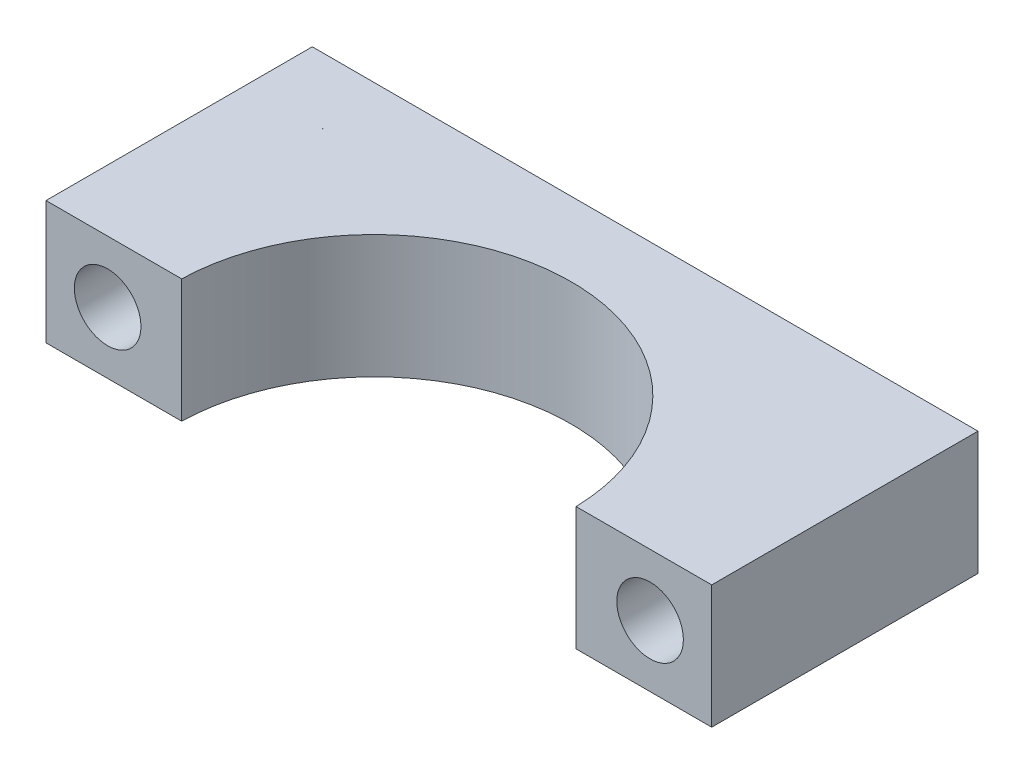
ISO-10303-21;
HEADER;
FILE_DESCRIPTION(('STEP AP214'),'2;1');
FILE_NAME('part.step','',(''),(''),'','','');
FILE_SCHEMA(('AUTOMOTIVE_DESIGN { 1 0 10303 214 1 1 1 1 }'));
ENDSEC;
DATA;
#1=APPLICATION_CONTEXT('core data for automotive mechanical design processes');
#2=APPLICATION_PROTOCOL_DEFINITION('international standard','automotive_design',2000,#1);
#3=PRODUCT_CONTEXT('',#1,'mechanical');
#4=PRODUCT('Part','Part','',(#3));
#5=PRODUCT_RELATED_PRODUCT_CATEGORY('part','',(#4));
#6=PRODUCT_DEFINITION_FORMATION('','',#4);
#7=PRODUCT_DEFINITION_CONTEXT('part definition',#1,'design');
#8=PRODUCT_DEFINITION('design','',#6,#7);
#9=PRODUCT_DEFINITION_SHAPE('','',#8);
#10=(LENGTH_UNIT() NAMED_UNIT(*) SI_UNIT(.MILLI.,.METRE.));
#11=(NAMED_UNIT(*) PLANE_ANGLE_UNIT() SI_UNIT($,.RADIAN.));
#12=(NAMED_UNIT(*) SI_UNIT($,.STERADIAN.) SOLID_ANGLE_UNIT());
#13=UNCERTAINTY_MEASURE_WITH_UNIT(LENGTH_MEASURE(1.E-05),#10,'distance_accuracy_value','');
#14=(GEOMETRIC_REPRESENTATION_CONTEXT(3) GLOBAL_UNCERTAINTY_ASSIGNED_CONTEXT((#13)) GLOBAL_UNIT_ASSIGNED_CONTEXT((#10,
#11,#12)) REPRESENTATION_CONTEXT('',''));
#15=CARTESIAN_POINT('',(0.,0.,0.));
#16=DIRECTION('',(0.,0.,1.));
#17=DIRECTION('',(1.,0.,0.));
#18=AXIS2_PLACEMENT_3D('',#15,#16,#17);
#19=CARTESIAN_POINT('',(-11.,2.5,-5.05999999999998));
#20=DIRECTION('',(0.,0.,1.));
#21=DIRECTION('',(1.,0.,0.));
#22=AXIS2_PLACEMENT_3D('',#19,#20,#21);
#23=CYLINDRICAL_SURFACE('',#22,1.35);
#24=CARTESIAN_POINT('',(-11.,2.5,-0.199999999999971));
#25=DIRECTION('',(0.,0.,-1.));
#26=DIRECTION('',(-1.,0.,0.));
#27=AXIS2_PLACEMENT_3D('',#24,#25,#26);
#28=CIRCLE('',#27,1.35);
#29=CARTESIAN_POINT('',(-12.35,2.5,-0.199999999999966));
#30=VERTEX_POINT('',#29);
#31=EDGE_CURVE('E101',#30,#30,#28,.T.);
#32=ORIENTED_EDGE('',*,*,#31,.F.);
#33=EDGE_LOOP('',(#32));
#34=FACE_BOUND('',#33,.T.);
#35=CARTESIAN_POINT('',(-11.,2.5,-11.));
#36=DIRECTION('',(0.,0.,1.));
#37=DIRECTION('',(1.,0.,0.));
#38=AXIS2_PLACEMENT_3D('',#35,#36,#37);
#39=CIRCLE('',#38,1.35);
#40=CARTESIAN_POINT('',(-9.65000000000001,2.5,-11.));
#41=VERTEX_POINT('',#40);
#42=EDGE_CURVE('E120',#41,#41,#39,.T.);
#43=ORIENTED_EDGE('',*,*,#42,.F.);
#44=EDGE_LOOP('',(#43));
#45=FACE_BOUND('',#44,.T.);
#46=ADVANCED_FACE('F17',(#34,#45),#23,.F.);
#47=CARTESIAN_POINT('',(11.,2.5,-5.05999999999999));
#48=DIRECTION('',(0.,0.,1.));
#49=DIRECTION('',(1.,0.,0.));
#50=AXIS2_PLACEMENT_3D('',#47,#48,#49);
#51=CYLINDRICAL_SURFACE('',#50,1.35);
#52=CARTESIAN_POINT('',(11.,2.5,-0.199999999999997));
#53=DIRECTION('',(0.,0.,-1.));
#54=DIRECTION('',(-1.,0.,0.));
#55=AXIS2_PLACEMENT_3D('',#52,#53,#54);
#56=CIRCLE('',#55,1.35);
#57=CARTESIAN_POINT('',(9.65,2.5,-0.199999999999997));
#58=VERTEX_POINT('',#57);
#59=EDGE_CURVE('E11',#58,#58,#56,.T.);
#60=ORIENTED_EDGE('',*,*,#59,.F.);
#61=EDGE_LOOP('',(#60));
#62=FACE_BOUND('',#61,.T.);
#63=CARTESIAN_POINT('',(11.,2.5,-11.));
#64=DIRECTION('',(0.,0.,1.));
#65=DIRECTION('',(1.,0.,0.));
#66=AXIS2_PLACEMENT_3D('',#63,#64,#65);
#67=CIRCLE('',#66,1.35);
#68=CARTESIAN_POINT('',(12.35,2.5,-11.));
#69=VERTEX_POINT('',#68);
#70=EDGE_CURVE('E124',#69,#69,#67,.T.);
#71=ORIENTED_EDGE('',*,*,#70,.F.);
#72=EDGE_LOOP('',(#71));
#73=FACE_BOUND('',#72,.T.);
#74=ADVANCED_FACE('F148',(#62,#73),#51,.F.);
#75=CARTESIAN_POINT('',(7.99749960925288,0.,-0.199999999999996));
#76=DIRECTION('',(0.,0.,1.));
#77=DIRECTION('',(1.,0.,0.));
#78=AXIS2_PLACEMENT_3D('',#75,#76,#77);
#79=PLANE('',#78);
#80=ORIENTED_EDGE('',*,*,#59,.T.);
#81=EDGE_LOOP('',(#80));
#82=FACE_BOUND('',#81,.T.);
#83=DIRECTION('',(-1.,0.,0.));
#84=VECTOR('',#83,1.);
#85=CARTESIAN_POINT('',(13.5,0.,-0.199999999999998));
#86=LINE('',#85,#84);
#87=CARTESIAN_POINT('',(13.5,0.,-0.199999999999998));
#88=VERTEX_POINT('',#87);
#89=CARTESIAN_POINT('',(7.99749960925288,0.,-0.199999999999996));
#90=VERTEX_POINT('',#89);
#91=EDGE_CURVE('E36',#88,#90,#86,.T.);
#92=ORIENTED_EDGE('',*,*,#91,.F.);
#93=DIRECTION('',(0.,1.,0.));
#94=VECTOR('',#93,1.);
#95=CARTESIAN_POINT('',(13.5,0.,-0.199999999999998));
#96=LINE('',#95,#94);
#97=CARTESIAN_POINT('',(13.5,5.,-0.199999999999998));
#98=VERTEX_POINT('',#97);
#99=EDGE_CURVE('E27',#88,#98,#96,.T.);
#100=ORIENTED_EDGE('',*,*,#99,.T.);
#101=DIRECTION('',(1.,0.,0.));
#102=VECTOR('',#101,1.);
#103=CARTESIAN_POINT('',(13.5,5.,-0.199999999999998));
#104=LINE('',#103,#102);
#105=CARTESIAN_POINT('',(7.99749960925288,5.,-0.199999999999996));
#106=VERTEX_POINT('',#105);
#107=EDGE_CURVE('E93',#106,#98,#104,.T.);
#108=ORIENTED_EDGE('',*,*,#107,.F.);
#109=DIRECTION('',(0.,1.,0.));
#110=VECTOR('',#109,1.);
#111=CARTESIAN_POINT('',(7.99749960925288,0.,-0.199999999999996));
#112=LINE('',#111,#110);
#113=EDGE_CURVE('E99',#90,#106,#112,.T.);
#114=ORIENTED_EDGE('',*,*,#113,.F.);
#115=EDGE_LOOP('',(#92,#100,#108,#114));
#116=FACE_BOUND('',#115,.T.);
#117=ADVANCED_FACE('F98',(#82,#116),#79,.T.);
#118=CARTESIAN_POINT('',(0.,0.,0.));
#119=DIRECTION('',(0.,1.,0.));
#120=DIRECTION('',(1.,0.,0.));
#121=AXIS2_PLACEMENT_3D('',#118,#119,#120);
#122=CYLINDRICAL_SURFACE('',#121,8.);
#123=CARTESIAN_POINT('',(0.,0.,0.));
#124=DIRECTION('',(0.,1.,0.));
#125=DIRECTION('',(1.,0.,0.));
#126=AXIS2_PLACEMENT_3D('',#123,#124,#125);
#127=CIRCLE('',#126,8.);
#128=CARTESIAN_POINT('',(-7.99749960925363,0.,-0.199999999999989));
#129=VERTEX_POINT('',#128);
#130=EDGE_CURVE('E106',#90,#129,#127,.T.);
#131=ORIENTED_EDGE('',*,*,#130,.F.);
#132=ORIENTED_EDGE('',*,*,#113,.T.);
#133=CARTESIAN_POINT('',(0.,5.,0.));
#134=DIRECTION('',(0.,-1.,0.));
#135=DIRECTION('',(0.,0.,-1.));
#136=AXIS2_PLACEMENT_3D('',#133,#134,#135);
#137=CIRCLE('',#136,8.);
#138=CARTESIAN_POINT('',(-7.99749960925363,5.,-0.199999999999989));
#139=VERTEX_POINT('',#138);
#140=EDGE_CURVE('E95',#139,#106,#137,.T.);
#141=ORIENTED_EDGE('',*,*,#140,.F.);
#142=DIRECTION('',(0.,1.,0.));
#143=VECTOR('',#142,1.);
#144=CARTESIAN_POINT('',(-7.99749960925363,0.,-0.199999999999989));
#145=LINE('',#144,#143);
#146=EDGE_CURVE('E111',#129,#139,#145,.T.);
#147=ORIENTED_EDGE('',*,*,#146,.F.);
#148=EDGE_LOOP('',(#131,#132,#141,#147));
#149=FACE_BOUND('',#148,.T.);
#150=ADVANCED_FACE('F19',(#149),#122,.F.);
#151=CARTESIAN_POINT('',(-13.5,0.,-0.19999999999997));
#152=DIRECTION('',(0.,0.,1.));
#153=DIRECTION('',(1.,0.,0.));
#154=AXIS2_PLACEMENT_3D('',#151,#152,#153);
#155=PLANE('',#154);
#156=ORIENTED_EDGE('',*,*,#31,.T.);
#157=EDGE_LOOP('',(#156));
#158=FACE_BOUND('',#157,.T.);
#159=DIRECTION('',(-1.,0.,0.));
#160=VECTOR('',#159,1.);
#161=CARTESIAN_POINT('',(-7.99749960925363,0.,-0.199999999999989));
#162=LINE('',#161,#160);
#163=CARTESIAN_POINT('',(-13.5,0.,-0.19999999999997));
#164=VERTEX_POINT('',#163);
#165=EDGE_CURVE('E108',#129,#164,#162,.T.);
#166=ORIENTED_EDGE('',*,*,#165,.F.);
#167=ORIENTED_EDGE('',*,*,#146,.T.);
#168=DIRECTION('',(1.,0.,0.));
#169=VECTOR('',#168,1.);
#170=CARTESIAN_POINT('',(-7.99749960925363,5.,-0.199999999999989));
#171=LINE('',#170,#169);
#172=CARTESIAN_POINT('',(-13.5,5.,-0.199999999999969));
#173=VERTEX_POINT('',#172);
#174=EDGE_CURVE('E110',#173,#139,#171,.T.);
#175=ORIENTED_EDGE('',*,*,#174,.F.);
#176=DIRECTION('',(0.,1.,0.));
#177=VECTOR('',#176,1.);
#178=CARTESIAN_POINT('',(-13.5,0.,-0.19999999999997));
#179=LINE('',#178,#177);
#180=EDGE_CURVE('E114',#164,#173,#179,.T.);
#181=ORIENTED_EDGE('',*,*,#180,.F.);
#182=EDGE_LOOP('',(#166,#167,#175,#181));
#183=FACE_BOUND('',#182,.T.);
#184=ADVANCED_FACE('F132',(#158,#183),#155,.T.);
#185=CARTESIAN_POINT('',(-13.5,0.,-11.));
#186=DIRECTION('',(-1.,0.,0.));
#187=DIRECTION('',(0.,0.,1.));
#188=AXIS2_PLACEMENT_3D('',#185,#186,#187);
#189=PLANE('',#188);
#190=DIRECTION('',(0.,0.,-1.));
#191=VECTOR('',#190,1.);
#192=CARTESIAN_POINT('',(-13.5,0.,-0.19999999999997));
#193=LINE('',#192,#191);
#194=CARTESIAN_POINT('',(-13.5,0.,-11.));
#195=VERTEX_POINT('',#194);
#196=EDGE_CURVE('E116',#164,#195,#193,.T.);
#197=ORIENTED_EDGE('',*,*,#196,.F.);
#198=ORIENTED_EDGE('',*,*,#180,.T.);
#199=DIRECTION('',(0.,0.,1.));
#200=VECTOR('',#199,1.);
#201=CARTESIAN_POINT('',(-13.5,5.,-0.19999999999997));
#202=LINE('',#201,#200);
#203=CARTESIAN_POINT('',(-13.5,5.,-11.));
#204=VERTEX_POINT('',#203);
#205=EDGE_CURVE('E84',#204,#173,#202,.T.);
#206=ORIENTED_EDGE('',*,*,#205,.F.);
#207=DIRECTION('',(0.,1.,0.));
#208=VECTOR('',#207,1.);
#209=CARTESIAN_POINT('',(-13.5,0.,-11.));
#210=LINE('',#209,#208);
#211=EDGE_CURVE('E80',#195,#204,#210,.T.);
#212=ORIENTED_EDGE('',*,*,#211,.F.);
#213=EDGE_LOOP('',(#197,#198,#206,#212));
#214=FACE_BOUND('',#213,.T.);
#215=ADVANCED_FACE('F135',(#214),#189,.T.);
#216=CARTESIAN_POINT('',(13.5,0.,-11.));
#217=DIRECTION('',(0.,0.,-1.));
#218=DIRECTION('',(-1.,0.,0.));
#219=AXIS2_PLACEMENT_3D('',#216,#217,#218);
#220=PLANE('',#219);
#221=ORIENTED_EDGE('',*,*,#42,.T.);
#222=EDGE_LOOP('',(#221));
#223=FACE_BOUND('',#222,.T.);
#224=ORIENTED_EDGE('',*,*,#70,.T.);
#225=EDGE_LOOP('',(#224));
#226=FACE_BOUND('',#225,.T.);
#227=DIRECTION('',(1.,0.,0.));
#228=VECTOR('',#227,1.);
#229=CARTESIAN_POINT('',(-13.5,0.,-11.));
#230=LINE('',#229,#228);
#231=CARTESIAN_POINT('',(13.5,0.,-11.));
#232=VERTEX_POINT('',#231);
#233=EDGE_CURVE('E68',#195,#232,#230,.T.);
#234=ORIENTED_EDGE('',*,*,#233,.F.);
#235=ORIENTED_EDGE('',*,*,#211,.T.);
#236=DIRECTION('',(-1.,0.,0.));
#237=VECTOR('',#236,1.);
#238=CARTESIAN_POINT('',(-13.5,5.,-11.));
#239=LINE('',#238,#237);
#240=CARTESIAN_POINT('',(13.5,5.,-11.));
#241=VERTEX_POINT('',#240);
#242=EDGE_CURVE('E74',#241,#204,#239,.T.);
#243=ORIENTED_EDGE('',*,*,#242,.F.);
#244=DIRECTION('',(0.,1.,0.));
#245=VECTOR('',#244,1.);
#246=CARTESIAN_POINT('',(13.5,0.,-11.));
#247=LINE('',#246,#245);
#248=EDGE_CURVE('E77',#232,#241,#247,.T.);
#249=ORIENTED_EDGE('',*,*,#248,.F.);
#250=EDGE_LOOP('',(#234,#235,#243,#249));
#251=FACE_BOUND('',#250,.T.);
#252=ADVANCED_FACE('F76',(#223,#226,#251),#220,.T.);
#253=CARTESIAN_POINT('',(13.5,0.,-0.199999999999998));
#254=DIRECTION('',(1.,0.,0.));
#255=DIRECTION('',(0.,0.,-1.));
#256=AXIS2_PLACEMENT_3D('',#253,#254,#255);
#257=PLANE('',#256);
#258=DIRECTION('',(0.,0.,1.));
#259=VECTOR('',#258,1.);
#260=CARTESIAN_POINT('',(13.5,0.,-11.));
#261=LINE('',#260,#259);
#262=EDGE_CURVE('E89',#232,#88,#261,.T.);
#263=ORIENTED_EDGE('',*,*,#262,.F.);
#264=ORIENTED_EDGE('',*,*,#248,.T.);
#265=DIRECTION('',(0.,0.,-1.));
#266=VECTOR('',#265,1.);
#267=CARTESIAN_POINT('',(13.5,5.,-11.));
#268=LINE('',#267,#266);
#269=EDGE_CURVE('E21',#98,#241,#268,.T.);
#270=ORIENTED_EDGE('',*,*,#269,.F.);
#271=ORIENTED_EDGE('',*,*,#99,.F.);
#272=EDGE_LOOP('',(#263,#264,#270,#271));
#273=FACE_BOUND('',#272,.T.);
#274=ADVANCED_FACE('F88',(#273),#257,.T.);
#275=CARTESIAN_POINT('',(0.,5.,-5.59999999999999));
#276=DIRECTION('',(0.,1.,0.));
#277=DIRECTION('',(0.,0.,1.));
#278=AXIS2_PLACEMENT_3D('',#275,#276,#277);
#279=PLANE('',#278);
#280=ORIENTED_EDGE('',*,*,#269,.T.);
#281=ORIENTED_EDGE('',*,*,#242,.T.);
#282=ORIENTED_EDGE('',*,*,#205,.T.);
#283=ORIENTED_EDGE('',*,*,#174,.T.);
#284=ORIENTED_EDGE('',*,*,#140,.T.);
#285=ORIENTED_EDGE('',*,*,#107,.T.);
#286=EDGE_LOOP('',(#280,#281,#282,#283,#284,#285));
#287=FACE_BOUND('',#286,.T.);
#288=ADVANCED_FACE('F91',(#287),#279,.T.);
#289=CARTESIAN_POINT('',(0.,0.,-5.59999999999999));
#290=DIRECTION('',(0.,1.,0.));
#291=DIRECTION('',(0.,0.,1.));
#292=AXIS2_PLACEMENT_3D('',#289,#290,#291);
#293=PLANE('',#292);
#294=ORIENTED_EDGE('',*,*,#262,.T.);
#295=ORIENTED_EDGE('',*,*,#91,.T.);
#296=ORIENTED_EDGE('',*,*,#130,.T.);
#297=ORIENTED_EDGE('',*,*,#165,.T.);
#298=ORIENTED_EDGE('',*,*,#196,.T.);
#299=ORIENTED_EDGE('',*,*,#233,.T.);
#300=EDGE_LOOP('',(#294,#295,#296,#297,#298,#299));
#301=FACE_BOUND('',#300,.T.);
#302=ADVANCED_FACE('F125',(#301),#293,.F.);
#303=CLOSED_SHELL('',(#46,#74,#117,#150,#184,#215,#252,#274,#288,#302));
#304=MANIFOLD_SOLID_BREP('B1',#303);
#305=ADVANCED_BREP_SHAPE_REPRESENTATION('',(#18,#304),#14);
#306=SHAPE_DEFINITION_REPRESENTATION(#9,#305);
ENDSEC;
END-ISO-10303-21;
